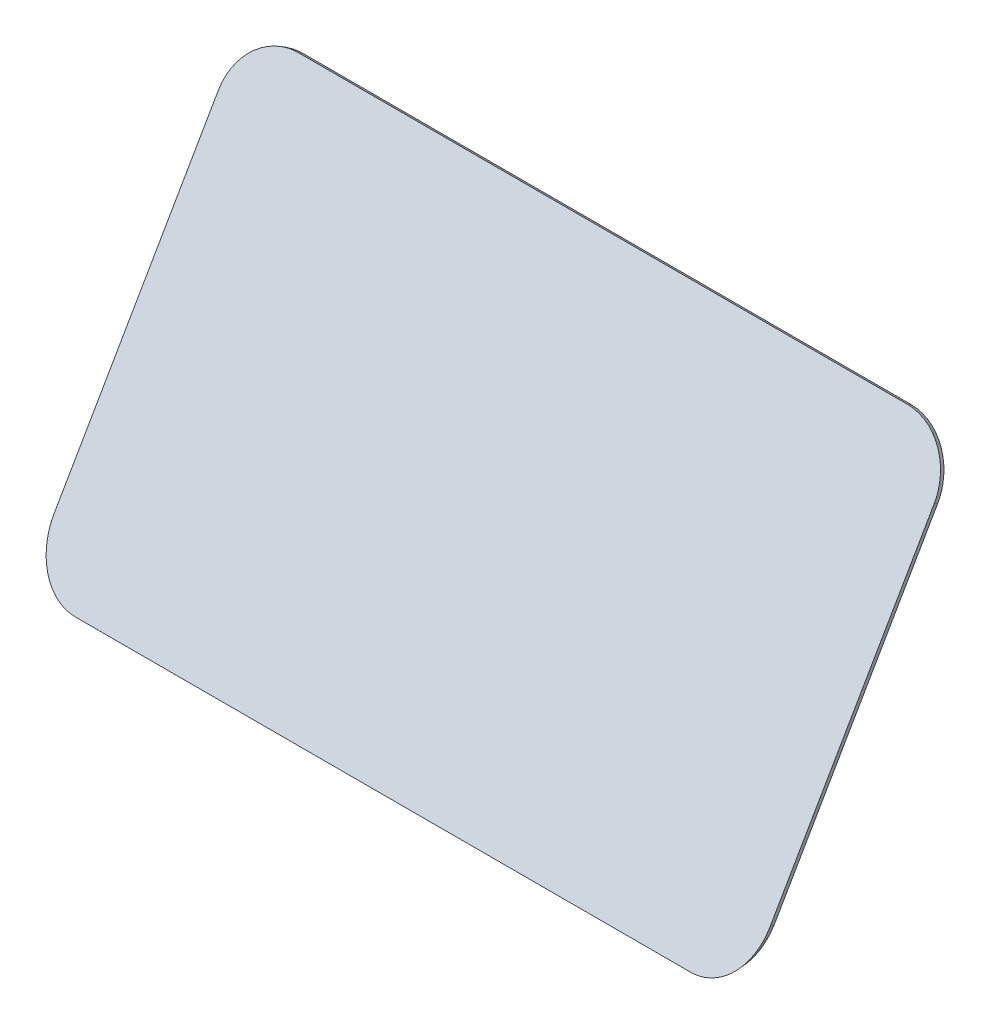
ISO-10303-21;
HEADER;
FILE_DESCRIPTION(('STEP AP214'),'2;1');
FILE_NAME('part.step','',(''),(''),'','','');
FILE_SCHEMA(('AUTOMOTIVE_DESIGN { 1 0 10303 214 1 1 1 1 }'));
ENDSEC;
DATA;
#1=APPLICATION_CONTEXT('core data for automotive mechanical design processes');
#2=APPLICATION_PROTOCOL_DEFINITION('international standard','automotive_design',2000,#1);
#3=PRODUCT_CONTEXT('',#1,'mechanical');
#4=PRODUCT('Part','Part','',(#3));
#5=PRODUCT_RELATED_PRODUCT_CATEGORY('part','',(#4));
#6=PRODUCT_DEFINITION_FORMATION('','',#4);
#7=PRODUCT_DEFINITION_CONTEXT('part definition',#1,'design');
#8=PRODUCT_DEFINITION('design','',#6,#7);
#9=PRODUCT_DEFINITION_SHAPE('','',#8);
#10=(LENGTH_UNIT() NAMED_UNIT(*) SI_UNIT(.MILLI.,.METRE.));
#11=(NAMED_UNIT(*) PLANE_ANGLE_UNIT() SI_UNIT($,.RADIAN.));
#12=(NAMED_UNIT(*) SI_UNIT($,.STERADIAN.) SOLID_ANGLE_UNIT());
#13=UNCERTAINTY_MEASURE_WITH_UNIT(LENGTH_MEASURE(1.E-05),#10,'distance_accuracy_value','');
#14=(GEOMETRIC_REPRESENTATION_CONTEXT(3) GLOBAL_UNCERTAINTY_ASSIGNED_CONTEXT((#13)) GLOBAL_UNIT_ASSIGNED_CONTEXT((#10,
#11,#12)) REPRESENTATION_CONTEXT('',''));
#15=CARTESIAN_POINT('',(0.,0.,0.));
#16=DIRECTION('',(0.,0.,1.));
#17=DIRECTION('',(1.,0.,0.));
#18=AXIS2_PLACEMENT_3D('',#15,#16,#17);
#19=CARTESIAN_POINT('',(94.5,0.,0.));
#20=DIRECTION('',(0.,1.,0.));
#21=DIRECTION('',(0.,0.,1.));
#22=AXIS2_PLACEMENT_3D('',#19,#20,#21);
#23=PLANE('',#22);
#24=DIRECTION('',(-1.,0.,0.));
#25=VECTOR('',#24,1.);
#26=CARTESIAN_POINT('',(94.5,0.,66.6143593539449));
#27=LINE('',#26,#25);
#28=CARTESIAN_POINT('',(81.0843131745159,0.,66.6143593539449));
#29=VERTEX_POINT('',#28);
#30=CARTESIAN_POINT('',(-81.084313174516,0.,66.6143593539449));
#31=VERTEX_POINT('',#30);
#32=EDGE_CURVE('E107',#29,#31,#27,.T.);
#33=ORIENTED_EDGE('',*,*,#32,.F.);
#34=DIRECTION('',(-0.101056297182943,0.,-0.994880708828789));
#35=VECTOR('',#34,1.);
#36=CARTESIAN_POINT('',(81.3606300722299,0.,69.3346485266365));
#37=LINE('',#36,#35);
#38=CARTESIAN_POINT('',(81.2250614186761,0.,68.));
#39=VERTEX_POINT('',#38);
#40=EDGE_CURVE('E137',#29,#39,#37,.F.);
#41=ORIENTED_EDGE('',*,*,#40,.T.);
#42=DIRECTION('',(-1.,0.,0.));
#43=VECTOR('',#42,1.);
#44=CARTESIAN_POINT('',(94.5,0.,68.));
#45=LINE('',#44,#43);
#46=CARTESIAN_POINT('',(-81.2250614186762,0.,68.));
#47=VERTEX_POINT('',#46);
#48=EDGE_CURVE('E160',#39,#47,#45,.T.);
#49=ORIENTED_EDGE('',*,*,#48,.T.);
#50=DIRECTION('',(-0.101056297182943,0.,0.994880708828789));
#51=VECTOR('',#50,1.);
#52=CARTESIAN_POINT('',(-74.4534419566518,0.,1.33464852663643));
#53=LINE('',#52,#51);
#54=EDGE_CURVE('E139',#47,#31,#53,.F.);
#55=ORIENTED_EDGE('',*,*,#54,.T.);
#56=EDGE_LOOP('',(#33,#41,#49,#55));
#57=FACE_BOUND('',#56,.T.);
#58=ADVANCED_FACE('F33',(#57),#23,.F.);
#59=CARTESIAN_POINT('',(-86.4041506893714,-5.06718020736777,-8.77661357026828));
#60=DIRECTION('',(-0.993191670700658,-0.0582458265690236,-0.100884730946393));
#61=DIRECTION('',(0.101056297182943,0.,-0.994880708828789));
#62=AXIS2_PLACEMENT_3D('',#59,#60,#61);
#63=PLANE('',#62);
#64=DIRECTION('',(0.116491653138046,-0.496595835350336,-0.860129217653875));
#65=VECTOR('',#64,1.);
#66=CARTESIAN_POINT('',(-92.1541959306633,78.3345911860124,-0.320508075689038));
#67=LINE('',#66,#65);
#68=CARTESIAN_POINT('',(-94.5,88.3345911860125,16.9999999999996));
#69=VERTEX_POINT('',#68);
#70=CARTESIAN_POINT('',(-94.3592517558398,87.7345911860125,15.9607695154583));
#71=VERTEX_POINT('',#70);
#72=EDGE_CURVE('E113',#69,#71,#67,.T.);
#73=ORIENTED_EDGE('',*,*,#72,.T.);
#74=DIRECTION('',(0.,-0.866025403784436,0.500000000000004));
#75=VECTOR('',#74,1.);
#76=CARTESIAN_POINT('',(-94.3592517558398,28.8448637286711,49.9607695154584));
#77=LINE('',#76,#75);
#78=CARTESIAN_POINT('',(-94.3592517558398,13.1845584280337,59.0022509963732));
#79=VERTEX_POINT('',#78);
#80=EDGE_CURVE('E98',#71,#79,#77,.T.);
#81=ORIENTED_EDGE('',*,*,#80,.T.);
#82=DIRECTION('',(-0.101056297182943,0.,0.994880708828789));
#83=VECTOR('',#82,1.);
#84=CARTESIAN_POINT('',(-95.2653134620391,13.1845584280337,67.922262293387));
#85=LINE('',#84,#83);
#86=CARTESIAN_POINT('',(-94.5,13.1845584280337,60.3878916424283));
#87=VERTEX_POINT('',#86);
#88=EDGE_CURVE('E120',#79,#87,#85,.T.);
#89=ORIENTED_EDGE('',*,*,#88,.T.);
#90=DIRECTION('',(0.,-0.866025403784436,0.500000000000004));
#91=VECTOR('',#90,1.);
#92=CARTESIAN_POINT('',(-94.5,0.,68.));
#93=LINE('',#92,#91);
#94=EDGE_CURVE('E119',#69,#87,#93,.T.);
#95=ORIENTED_EDGE('',*,*,#94,.F.);
#96=EDGE_LOOP('',(#73,#81,#89,#95));
#97=FACE_BOUND('',#96,.T.);
#98=ADVANCED_FACE('F117',(#97),#63,.T.);
#99=CARTESIAN_POINT('',(-73.5589112968364,14.,-7.4718417338878));
#100=DIRECTION('',(0.101056297182943,0.,-0.994880708828789));
#101=DIRECTION('',(-0.994880708828789,0.,-0.101056297182943));
#102=AXIS2_PLACEMENT_3D('',#99,#100,#101);
#103=CYLINDRICAL_SURFACE('',#102,14.);
#104=ORIENTED_EDGE('',*,*,#88,.F.);
#105=CARTESIAN_POINT('',(-80.2632817502481,14.,58.5314555852901));
#106=DIRECTION('',(0.,-0.500000000000004,-0.866025403784436));
#107=DIRECTION('',(0.199085892098194,0.848689345800686,-0.489991022256399));
#108=AXIS2_PLACEMENT_3D('',#105,#106,#107);
#109=ELLIPSE('',#108,16.248990852723,14.);
#110=EDGE_CURVE('E103',#79,#31,#109,.F.);
#111=ORIENTED_EDGE('',*,*,#110,.T.);
#112=ORIENTED_EDGE('',*,*,#54,.F.);
#113=CARTESIAN_POINT('',(-80.4040299944083,14.,59.9170962313452));
#114=DIRECTION('',(0.,-0.500000000000004,-0.866025403784436));
#115=DIRECTION('',(0.199085892098194,0.848689345800686,-0.489991022256399));
#116=AXIS2_PLACEMENT_3D('',#113,#114,#115);
#117=ELLIPSE('',#116,16.248990852723,14.);
#118=EDGE_CURVE('E135',#87,#47,#117,.F.);
#119=ORIENTED_EDGE('',*,*,#118,.F.);
#120=EDGE_LOOP('',(#104,#111,#112,#119));
#121=FACE_BOUND('',#120,.T.);
#122=ADVANCED_FACE('F191',(#121),#103,.T.);
#123=CARTESIAN_POINT('',(-72.4994672995621,54.6379888219397,-41.364227337019));
#124=DIRECTION('',(-0.116491653138046,0.496595835350336,0.860129217653875));
#125=DIRECTION('',(0.,-0.866025403784435,0.500000000000007));
#126=AXIS2_PLACEMENT_3D('',#123,#124,#125);
#127=CYLINDRICAL_SURFACE('',#126,14.);
#128=DIRECTION('',(0.116491653138046,-0.496595835350336,-0.860129217653875));
#129=VECTOR('',#128,1.);
#130=CARTESIAN_POINT('',(-80.5953166101908,101.274388410961,11.4123862332491));
#131=LINE('',#130,#129);
#132=CARTESIAN_POINT('',(-80.2632817502481,99.8589468389946,8.96076951545822));
#133=VERTEX_POINT('',#132);
#134=CARTESIAN_POINT('',(-80.4040299944083,100.458946838995,9.99999999999955));
#135=VERTEX_POINT('',#134);
#136=EDGE_CURVE('E56',#133,#135,#131,.F.);
#137=ORIENTED_EDGE('',*,*,#136,.F.);
#138=CARTESIAN_POINT('',(-80.2632817502481,87.7345911860125,15.9607695154583));
#139=DIRECTION('',(0.,-0.500000000000004,-0.866025403784436));
#140=DIRECTION('',(-1.,0.,0.));
#141=AXIS2_PLACEMENT_3D('',#138,#139,#140);
#142=ELLIPSE('',#141,14.0959700055917,14.);
#143=EDGE_CURVE('E101',#133,#71,#142,.F.);
#144=ORIENTED_EDGE('',*,*,#143,.T.);
#145=ORIENTED_EDGE('',*,*,#72,.F.);
#146=CARTESIAN_POINT('',(-80.4040299944083,88.3345911860125,16.9999999999996));
#147=DIRECTION('',(0.,-0.500000000000004,-0.866025403784436));
#148=DIRECTION('',(-1.,0.,0.));
#149=AXIS2_PLACEMENT_3D('',#146,#147,#148);
#150=ELLIPSE('',#149,14.0959700055917,14.);
#151=EDGE_CURVE('E133',#135,#69,#150,.F.);
#152=ORIENTED_EDGE('',*,*,#151,.F.);
#153=EDGE_LOOP('',(#137,#144,#145,#152));
#154=FACE_BOUND('',#153,.T.);
#155=ADVANCED_FACE('F111',(#154),#127,.T.);
#156=CARTESIAN_POINT('',(73.5589112968364,14.,-7.4718417338878));
#157=DIRECTION('',(0.101056297182943,0.,0.994880708828789));
#158=DIRECTION('',(0.994880708828789,0.,-0.101056297182943));
#159=AXIS2_PLACEMENT_3D('',#156,#157,#158);
#160=CYLINDRICAL_SURFACE('',#159,14.);
#161=ORIENTED_EDGE('',*,*,#40,.F.);
#162=CARTESIAN_POINT('',(80.2632817502481,14.,58.5314555852901));
#163=DIRECTION('',(0.,-0.500000000000004,-0.866025403784436));
#164=DIRECTION('',(0.199085892098194,-0.848689345800686,0.489991022256399));
#165=AXIS2_PLACEMENT_3D('',#162,#163,#164);
#166=ELLIPSE('',#165,16.248990852723,14.);
#167=CARTESIAN_POINT('',(94.3592517558398,13.1845584280337,59.0022509963732));
#168=VERTEX_POINT('',#167);
#169=EDGE_CURVE('E114',#29,#168,#166,.F.);
#170=ORIENTED_EDGE('',*,*,#169,.T.);
#171=DIRECTION('',(-0.101056297182943,0.,-0.994880708828789));
#172=VECTOR('',#171,1.);
#173=CARTESIAN_POINT('',(88.3581253464611,13.1845584280337,-0.0777377066130647));
#174=LINE('',#173,#172);
#175=CARTESIAN_POINT('',(94.5,13.1845584280337,60.3878916424283));
#176=VERTEX_POINT('',#175);
#177=EDGE_CURVE('E11',#176,#168,#174,.T.);
#178=ORIENTED_EDGE('',*,*,#177,.F.);
#179=CARTESIAN_POINT('',(80.4040299944083,14.,59.9170962313452));
#180=DIRECTION('',(0.,-0.500000000000004,-0.866025403784436));
#181=DIRECTION('',(0.199085892098194,-0.848689345800686,0.489991022256399));
#182=AXIS2_PLACEMENT_3D('',#179,#180,#181);
#183=ELLIPSE('',#182,16.248990852723,14.);
#184=EDGE_CURVE('E131',#39,#176,#183,.F.);
#185=ORIENTED_EDGE('',*,*,#184,.F.);
#186=EDGE_LOOP('',(#161,#170,#178,#185));
#187=FACE_BOUND('',#186,.T.);
#188=ADVANCED_FACE('F163',(#187),#160,.T.);
#189=CARTESIAN_POINT('',(72.4994672995621,54.6379888219397,-41.364227337019));
#190=DIRECTION('',(-0.116491653138046,-0.496595835350336,-0.860129217653875));
#191=DIRECTION('',(0.,0.866025403784435,-0.500000000000007));
#192=AXIS2_PLACEMENT_3D('',#189,#190,#191);
#193=CYLINDRICAL_SURFACE('',#192,14.);
#194=DIRECTION('',(0.116491653138046,0.496595835350336,0.860129217653875));
#195=VECTOR('',#194,1.);
#196=CARTESIAN_POINT('',(94.5,88.3345911860125,16.9999999999996));
#197=LINE('',#196,#195);
#198=CARTESIAN_POINT('',(94.3592517558398,87.7345911860125,15.9607695154583));
#199=VERTEX_POINT('',#198);
#200=CARTESIAN_POINT('',(94.5,88.3345911860125,16.9999999999996));
#201=VERTEX_POINT('',#200);
#202=EDGE_CURVE('E42',#199,#201,#197,.T.);
#203=ORIENTED_EDGE('',*,*,#202,.F.);
#204=CARTESIAN_POINT('',(80.2632817502481,87.7345911860125,15.9607695154583));
#205=DIRECTION('',(0.,-0.500000000000004,-0.866025403784436));
#206=DIRECTION('',(-1.,0.,0.));
#207=AXIS2_PLACEMENT_3D('',#204,#205,#206);
#208=ELLIPSE('',#207,14.0959700055917,14.);
#209=CARTESIAN_POINT('',(80.2632817502481,99.8589468389946,8.96076951545823));
#210=VERTEX_POINT('',#209);
#211=EDGE_CURVE('E166',#199,#210,#208,.F.);
#212=ORIENTED_EDGE('',*,*,#211,.T.);
#213=DIRECTION('',(0.116491653138046,0.496595835350336,0.860129217653875));
#214=VECTOR('',#213,1.);
#215=CARTESIAN_POINT('',(78.2495125408541,91.2743884109608,-5.90812184243963));
#216=LINE('',#215,#214);
#217=CARTESIAN_POINT('',(80.4040299944083,100.458946838995,9.99999999999955));
#218=VERTEX_POINT('',#217);
#219=EDGE_CURVE('E142',#218,#210,#216,.F.);
#220=ORIENTED_EDGE('',*,*,#219,.F.);
#221=CARTESIAN_POINT('',(80.4040299944083,88.3345911860125,16.9999999999996));
#222=DIRECTION('',(0.,-0.500000000000004,-0.866025403784436));
#223=DIRECTION('',(-1.,0.,0.));
#224=AXIS2_PLACEMENT_3D('',#221,#222,#223);
#225=ELLIPSE('',#224,14.0959700055917,14.);
#226=EDGE_CURVE('E123',#201,#218,#225,.F.);
#227=ORIENTED_EDGE('',*,*,#226,.F.);
#228=EDGE_LOOP('',(#203,#212,#220,#227));
#229=FACE_BOUND('',#228,.T.);
#230=ADVANCED_FACE('F35',(#229),#193,.T.);
#231=CARTESIAN_POINT('',(94.5,100.458946838995,9.99999999999955));
#232=DIRECTION('',(0.,-0.866025403784435,0.500000000000007));
#233=DIRECTION('',(0.,-0.500000000000007,-0.866025403784435));
#234=AXIS2_PLACEMENT_3D('',#231,#232,#233);
#235=PLANE('',#234);
#236=ORIENTED_EDGE('',*,*,#219,.T.);
#237=DIRECTION('',(-1.,0.,0.));
#238=VECTOR('',#237,1.);
#239=CARTESIAN_POINT('',(94.5,99.8589468389946,8.96076951545822));
#240=LINE('',#239,#238);
#241=EDGE_CURVE('E49',#210,#133,#240,.T.);
#242=ORIENTED_EDGE('',*,*,#241,.T.);
#243=ORIENTED_EDGE('',*,*,#136,.T.);
#244=DIRECTION('',(-1.,0.,0.));
#245=VECTOR('',#244,1.);
#246=CARTESIAN_POINT('',(94.5,100.458946838995,9.99999999999955));
#247=LINE('',#246,#245);
#248=EDGE_CURVE('E126',#218,#135,#247,.T.);
#249=ORIENTED_EDGE('',*,*,#248,.F.);
#250=EDGE_LOOP('',(#236,#242,#243,#249));
#251=FACE_BOUND('',#250,.T.);
#252=ADVANCED_FACE('F175',(#251),#235,.F.);
#253=CARTESIAN_POINT('',(94.5,0.,68.));
#254=DIRECTION('',(0.,-0.500000000000004,-0.866025403784436));
#255=DIRECTION('',(0.,0.866025403784436,-0.500000000000004));
#256=AXIS2_PLACEMENT_3D('',#253,#254,#255);
#257=PLANE('',#256);
#258=ORIENTED_EDGE('',*,*,#94,.T.);
#259=ORIENTED_EDGE('',*,*,#118,.T.);
#260=ORIENTED_EDGE('',*,*,#48,.F.);
#261=ORIENTED_EDGE('',*,*,#184,.T.);
#262=DIRECTION('',(0.,-0.866025403784436,0.500000000000004));
#263=VECTOR('',#262,1.);
#264=CARTESIAN_POINT('',(94.5,0.,68.));
#265=LINE('',#264,#263);
#266=EDGE_CURVE('E121',#201,#176,#265,.T.);
#267=ORIENTED_EDGE('',*,*,#266,.F.);
#268=ORIENTED_EDGE('',*,*,#226,.T.);
#269=ORIENTED_EDGE('',*,*,#248,.T.);
#270=ORIENTED_EDGE('',*,*,#151,.T.);
#271=EDGE_LOOP('',(#258,#259,#260,#261,#267,#268,#269,#270));
#272=FACE_BOUND('',#271,.T.);
#273=ADVANCED_FACE('F156',(#272),#257,.F.);
#274=CARTESIAN_POINT('',(86.4041506893714,-5.06718020736777,-8.77661357026828));
#275=DIRECTION('',(0.993191670700658,-0.0582458265690236,-0.100884730946393));
#276=DIRECTION('',(-0.101056297182943,0.,-0.994880708828789));
#277=AXIS2_PLACEMENT_3D('',#274,#275,#276);
#278=PLANE('',#277);
#279=DIRECTION('',(0.,-0.866025403784436,0.500000000000004));
#280=VECTOR('',#279,1.);
#281=CARTESIAN_POINT('',(94.3592517558398,-0.600000000000013,66.9607695154587));
#282=LINE('',#281,#280);
#283=EDGE_CURVE('E152',#199,#168,#282,.T.);
#284=ORIENTED_EDGE('',*,*,#283,.F.);
#285=ORIENTED_EDGE('',*,*,#202,.T.);
#286=ORIENTED_EDGE('',*,*,#266,.T.);
#287=ORIENTED_EDGE('',*,*,#177,.T.);
#288=EDGE_LOOP('',(#284,#285,#286,#287));
#289=FACE_BOUND('',#288,.T.);
#290=ADVANCED_FACE('F149',(#289),#278,.T.);
#291=CARTESIAN_POINT('',(94.5,-0.600000000000013,66.9607695154587));
#292=DIRECTION('',(0.,-0.500000000000004,-0.866025403784436));
#293=DIRECTION('',(0.,0.866025403784436,-0.500000000000004));
#294=AXIS2_PLACEMENT_3D('',#291,#292,#293);
#295=PLANE('',#294);
#296=ORIENTED_EDGE('',*,*,#80,.F.);
#297=ORIENTED_EDGE('',*,*,#143,.F.);
#298=ORIENTED_EDGE('',*,*,#241,.F.);
#299=ORIENTED_EDGE('',*,*,#211,.F.);
#300=ORIENTED_EDGE('',*,*,#283,.T.);
#301=ORIENTED_EDGE('',*,*,#169,.F.);
#302=ORIENTED_EDGE('',*,*,#32,.T.);
#303=ORIENTED_EDGE('',*,*,#110,.F.);
#304=EDGE_LOOP('',(#296,#297,#298,#299,#300,#301,#302,#303));
#305=FACE_BOUND('',#304,.T.);
#306=ADVANCED_FACE('F100',(#305),#295,.T.);
#307=CLOSED_SHELL('',(#58,#98,#122,#155,#188,#230,#252,#273,#290,#306));
#308=MANIFOLD_SOLID_BREP('B2',#307);
#309=ADVANCED_BREP_SHAPE_REPRESENTATION('',(#18,#308),#14);
#310=SHAPE_DEFINITION_REPRESENTATION(#9,#309);
ENDSEC;
END-ISO-10303-21;
